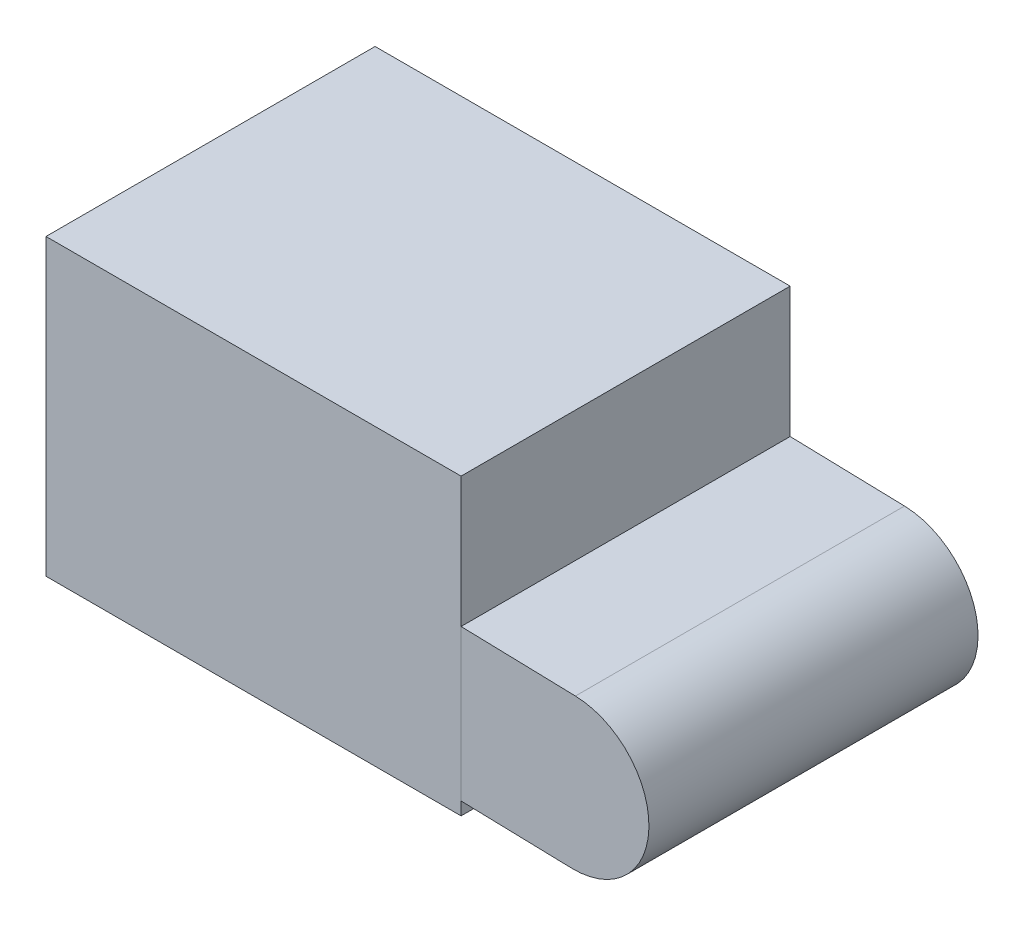
ISO-10303-21;
HEADER;
FILE_DESCRIPTION(('STEP AP214'),'2;1');
FILE_NAME('part.step','',(''),(''),'','','');
FILE_SCHEMA(('AUTOMOTIVE_DESIGN { 1 0 10303 214 1 1 1 1 }'));
ENDSEC;
DATA;
#1=APPLICATION_CONTEXT('core data for automotive mechanical design processes');
#2=APPLICATION_PROTOCOL_DEFINITION('international standard','automotive_design',2000,#1);
#3=PRODUCT_CONTEXT('',#1,'mechanical');
#4=PRODUCT('Part','Part','',(#3));
#5=PRODUCT_RELATED_PRODUCT_CATEGORY('part','',(#4));
#6=PRODUCT_DEFINITION_FORMATION('','',#4);
#7=PRODUCT_DEFINITION_CONTEXT('part definition',#1,'design');
#8=PRODUCT_DEFINITION('design','',#6,#7);
#9=PRODUCT_DEFINITION_SHAPE('','',#8);
#10=(LENGTH_UNIT() NAMED_UNIT(*) SI_UNIT(.MILLI.,.METRE.));
#11=(NAMED_UNIT(*) PLANE_ANGLE_UNIT() SI_UNIT($,.RADIAN.));
#12=(NAMED_UNIT(*) SI_UNIT($,.STERADIAN.) SOLID_ANGLE_UNIT());
#13=UNCERTAINTY_MEASURE_WITH_UNIT(LENGTH_MEASURE(1.E-05),#10,'distance_accuracy_value','');
#14=(GEOMETRIC_REPRESENTATION_CONTEXT(3) GLOBAL_UNCERTAINTY_ASSIGNED_CONTEXT((#13)) GLOBAL_UNIT_ASSIGNED_CONTEXT((#10,
#11,#12)) REPRESENTATION_CONTEXT('',''));
#15=CARTESIAN_POINT('',(0.,0.,0.));
#16=DIRECTION('',(0.,0.,1.));
#17=DIRECTION('',(1.,0.,0.));
#18=AXIS2_PLACEMENT_3D('',#15,#16,#17);
#19=CARTESIAN_POINT('',(35.1077098854944,-21.9746686635744,51.));
#20=DIRECTION('',(0.,0.,-1.));
#21=DIRECTION('',(-1.,0.,0.));
#22=AXIS2_PLACEMENT_3D('',#19,#20,#21);
#23=CYLINDRICAL_SURFACE('',#22,11.703993338653);
#24=CARTESIAN_POINT('',(35.1077098854944,-21.9746686635744,0.));
#25=DIRECTION('',(0.,0.,1.));
#26=DIRECTION('',(1.,0.,0.));
#27=AXIS2_PLACEMENT_3D('',#24,#25,#26);
#28=CIRCLE('',#27,11.703993338653);
#29=CARTESIAN_POINT('',(34.7969558700416,-33.6745358428682,0.));
#30=VERTEX_POINT('',#29);
#31=CARTESIAN_POINT('',(35.4184639009472,-10.2748014842807,0.));
#32=VERTEX_POINT('',#31);
#33=EDGE_CURVE('E108',#30,#32,#28,.T.);
#34=ORIENTED_EDGE('',*,*,#33,.T.);
#35=DIRECTION('',(0.,0.,-1.));
#36=VECTOR('',#35,1.);
#37=CARTESIAN_POINT('',(35.4184639009472,-10.2748014842807,51.));
#38=LINE('',#37,#36);
#39=CARTESIAN_POINT('',(35.4184639009472,-10.2748014842807,51.));
#40=VERTEX_POINT('',#39);
#41=EDGE_CURVE('E12',#40,#32,#38,.T.);
#42=ORIENTED_EDGE('',*,*,#41,.F.);
#43=CARTESIAN_POINT('',(35.1077098854944,-21.9746686635744,51.));
#44=DIRECTION('',(0.,0.,1.));
#45=DIRECTION('',(1.,0.,0.));
#46=AXIS2_PLACEMENT_3D('',#43,#44,#45);
#47=CIRCLE('',#46,11.703993338653);
#48=CARTESIAN_POINT('',(34.7969558700416,-33.6745358428682,51.));
#49=VERTEX_POINT('',#48);
#50=EDGE_CURVE('E96',#49,#40,#47,.T.);
#51=ORIENTED_EDGE('',*,*,#50,.F.);
#52=DIRECTION('',(0.,0.,-1.));
#53=VECTOR('',#52,1.);
#54=CARTESIAN_POINT('',(34.7969558700416,-33.6745358428682,51.));
#55=LINE('',#54,#53);
#56=EDGE_CURVE('E104',#49,#30,#55,.T.);
#57=ORIENTED_EDGE('',*,*,#56,.T.);
#58=EDGE_LOOP('',(#34,#42,#51,#57));
#59=FACE_BOUND('',#58,.T.);
#60=ADVANCED_FACE('F45',(#59),#23,.T.);
#61=CARTESIAN_POINT('',(35.4184639009472,-10.2748014842807,51.));
#62=DIRECTION('',(-0.0265511100750977,-0.999647457133654,0.));
#63=DIRECTION('',(0.999647457133654,-0.0265511100750977,0.));
#64=AXIS2_PLACEMENT_3D('',#61,#62,#63);
#65=PLANE('',#64);
#66=DIRECTION('',(-0.999647457133654,0.0265511100750977,0.));
#67=VECTOR('',#66,1.);
#68=CARTESIAN_POINT('',(35.4184639009472,-10.2748014842807,0.));
#69=LINE('',#68,#67);
#70=CARTESIAN_POINT('',(4.65808177789852,-9.45779116141854,0.));
#71=VERTEX_POINT('',#70);
#72=EDGE_CURVE('E100',#32,#71,#69,.T.);
#73=ORIENTED_EDGE('',*,*,#72,.T.);
#74=DIRECTION('',(0.,0.,-1.));
#75=VECTOR('',#74,1.);
#76=CARTESIAN_POINT('',(4.65808177789852,-9.45779116141854,51.));
#77=LINE('',#76,#75);
#78=CARTESIAN_POINT('',(4.65808177789852,-9.45779116141854,51.));
#79=VERTEX_POINT('',#78);
#80=EDGE_CURVE('E53',#79,#71,#77,.T.);
#81=ORIENTED_EDGE('',*,*,#80,.F.);
#82=DIRECTION('',(-0.999647457133654,0.0265511100750977,0.));
#83=VECTOR('',#82,1.);
#84=CARTESIAN_POINT('',(35.4184639009472,-10.2748014842807,51.));
#85=LINE('',#84,#83);
#86=EDGE_CURVE('E91',#40,#79,#85,.T.);
#87=ORIENTED_EDGE('',*,*,#86,.F.);
#88=ORIENTED_EDGE('',*,*,#41,.T.);
#89=EDGE_LOOP('',(#73,#81,#87,#88));
#90=FACE_BOUND('',#89,.T.);
#91=ADVANCED_FACE('F99',(#90),#65,.F.);
#92=CARTESIAN_POINT('',(4.34732776244573,-21.1576583407123,51.));
#93=DIRECTION('',(0.,0.,-1.));
#94=DIRECTION('',(-1.,0.,0.));
#95=AXIS2_PLACEMENT_3D('',#92,#93,#94);
#96=CYLINDRICAL_SURFACE('',#95,11.703993338653);
#97=CARTESIAN_POINT('',(4.34732776244573,-21.1576583407123,0.));
#98=DIRECTION('',(0.,0.,1.));
#99=DIRECTION('',(1.,0.,0.));
#100=AXIS2_PLACEMENT_3D('',#97,#98,#99);
#101=CIRCLE('',#100,11.703993338653);
#102=CARTESIAN_POINT('',(4.03657374699294,-32.857525520006,0.));
#103=VERTEX_POINT('',#102);
#104=EDGE_CURVE('E78',#71,#103,#101,.T.);
#105=ORIENTED_EDGE('',*,*,#104,.T.);
#106=DIRECTION('',(0.,0.,-1.));
#107=VECTOR('',#106,1.);
#108=CARTESIAN_POINT('',(4.03657374699294,-32.857525520006,51.));
#109=LINE('',#108,#107);
#110=CARTESIAN_POINT('',(4.03657374699294,-32.857525520006,51.));
#111=VERTEX_POINT('',#110);
#112=EDGE_CURVE('E101',#111,#103,#109,.T.);
#113=ORIENTED_EDGE('',*,*,#112,.F.);
#114=CARTESIAN_POINT('',(4.34732776244573,-21.1576583407123,51.));
#115=DIRECTION('',(0.,0.,1.));
#116=DIRECTION('',(1.,0.,0.));
#117=AXIS2_PLACEMENT_3D('',#114,#115,#116);
#118=CIRCLE('',#117,11.703993338653);
#119=EDGE_CURVE('E94',#79,#111,#118,.T.);
#120=ORIENTED_EDGE('',*,*,#119,.F.);
#121=ORIENTED_EDGE('',*,*,#80,.T.);
#122=EDGE_LOOP('',(#105,#113,#120,#121));
#123=FACE_BOUND('',#122,.T.);
#124=ADVANCED_FACE('F102',(#123),#96,.T.);
#125=CARTESIAN_POINT('',(34.7969558700416,-33.6745358428682,51.));
#126=DIRECTION('',(0.0265511100750977,0.999647457133654,0.));
#127=DIRECTION('',(-0.999647457133654,0.0265511100750977,0.));
#128=AXIS2_PLACEMENT_3D('',#125,#126,#127);
#129=PLANE('',#128);
#130=DIRECTION('',(0.999647457133654,-0.0265511100750977,0.));
#131=VECTOR('',#130,1.);
#132=CARTESIAN_POINT('',(34.7969558700416,-33.6745358428682,0.));
#133=LINE('',#132,#131);
#134=EDGE_CURVE('E84',#103,#30,#133,.T.);
#135=ORIENTED_EDGE('',*,*,#134,.T.);
#136=ORIENTED_EDGE('',*,*,#56,.F.);
#137=DIRECTION('',(0.999647457133654,-0.0265511100750977,0.));
#138=VECTOR('',#137,1.);
#139=CARTESIAN_POINT('',(34.7969558700416,-33.6745358428682,51.));
#140=LINE('',#139,#138);
#141=EDGE_CURVE('E61',#111,#49,#140,.T.);
#142=ORIENTED_EDGE('',*,*,#141,.F.);
#143=ORIENTED_EDGE('',*,*,#112,.T.);
#144=EDGE_LOOP('',(#135,#136,#142,#143));
#145=FACE_BOUND('',#144,.T.);
#146=ADVANCED_FACE('F115',(#145),#129,.F.);
#147=CARTESIAN_POINT('',(35.1077098854944,-21.9746686635744,51.));
#148=DIRECTION('',(0.,0.,1.));
#149=DIRECTION('',(1.,0.,0.));
#150=AXIS2_PLACEMENT_3D('',#147,#148,#149);
#151=PLANE('',#150);
#152=ORIENTED_EDGE('',*,*,#50,.T.);
#153=ORIENTED_EDGE('',*,*,#86,.T.);
#154=ORIENTED_EDGE('',*,*,#119,.T.);
#155=ORIENTED_EDGE('',*,*,#141,.T.);
#156=EDGE_LOOP('',(#152,#153,#154,#155));
#157=FACE_BOUND('',#156,.T.);
#158=ADVANCED_FACE('F92',(#157),#151,.T.);
#159=CARTESIAN_POINT('',(35.1077098854944,-21.9746686635744,0.));
#160=DIRECTION('',(0.,0.,1.));
#161=DIRECTION('',(1.,0.,0.));
#162=AXIS2_PLACEMENT_3D('',#159,#160,#161);
#163=PLANE('',#162);
#164=ORIENTED_EDGE('',*,*,#33,.F.);
#165=ORIENTED_EDGE('',*,*,#134,.F.);
#166=ORIENTED_EDGE('',*,*,#104,.F.);
#167=ORIENTED_EDGE('',*,*,#72,.F.);
#168=EDGE_LOOP('',(#164,#165,#166,#167));
#169=FACE_BOUND('',#168,.T.);
#170=ADVANCED_FACE('F118',(#169),#163,.F.);
#171=CLOSED_SHELL('',(#60,#91,#124,#146,#158,#170));
#172=MANIFOLD_SOLID_BREP('B2',#171);
#173=CARTESIAN_POINT('',(-46.6277300233939,10.3806260271059,51.));
#174=DIRECTION('',(1.,0.,0.));
#175=DIRECTION('',(0.,0.,-1.));
#176=AXIS2_PLACEMENT_3D('',#173,#174,#175);
#177=PLANE('',#176);
#178=DIRECTION('',(0.,-1.,0.));
#179=VECTOR('',#178,1.);
#180=CARTESIAN_POINT('',(-46.6277300233939,10.3806260271059,0.));
#181=LINE('',#180,#179);
#182=CARTESIAN_POINT('',(-46.6277300233939,10.3806260271059,0.));
#183=VERTEX_POINT('',#182);
#184=CARTESIAN_POINT('',(-46.6277300233939,-35.2260588132939,0.));
#185=VERTEX_POINT('',#184);
#186=EDGE_CURVE('E234',#183,#185,#181,.T.);
#187=ORIENTED_EDGE('',*,*,#186,.T.);
#188=DIRECTION('',(0.,0.,-1.));
#189=VECTOR('',#188,1.);
#190=CARTESIAN_POINT('',(-46.6277300233939,-35.2260588132939,51.));
#191=LINE('',#190,#189);
#192=CARTESIAN_POINT('',(-46.6277300233939,-35.2260588132939,51.));
#193=VERTEX_POINT('',#192);
#194=EDGE_CURVE('E43',#193,#185,#191,.T.);
#195=ORIENTED_EDGE('',*,*,#194,.F.);
#196=DIRECTION('',(0.,-1.,0.));
#197=VECTOR('',#196,1.);
#198=CARTESIAN_POINT('',(-46.6277300233939,10.3806260271059,51.));
#199=LINE('',#198,#197);
#200=CARTESIAN_POINT('',(-46.6277300233939,10.3806260271059,51.));
#201=VERTEX_POINT('',#200);
#202=EDGE_CURVE('E222',#201,#193,#199,.T.);
#203=ORIENTED_EDGE('',*,*,#202,.F.);
#204=DIRECTION('',(0.,0.,-1.));
#205=VECTOR('',#204,1.);
#206=CARTESIAN_POINT('',(-46.6277300233939,10.3806260271059,51.));
#207=LINE('',#206,#205);
#208=EDGE_CURVE('E230',#201,#183,#207,.T.);
#209=ORIENTED_EDGE('',*,*,#208,.T.);
#210=EDGE_LOOP('',(#187,#195,#203,#209));
#211=FACE_BOUND('',#210,.T.);
#212=ADVANCED_FACE('F171',(#211),#177,.F.);
#213=CARTESIAN_POINT('',(-46.6277300233939,-35.2260588132939,51.));
#214=DIRECTION('',(0.,1.,0.));
#215=DIRECTION('',(0.,0.,1.));
#216=AXIS2_PLACEMENT_3D('',#213,#214,#215);
#217=PLANE('',#216);
#218=DIRECTION('',(1.,0.,0.));
#219=VECTOR('',#218,1.);
#220=CARTESIAN_POINT('',(-46.6277300233939,-35.2260588132939,0.));
#221=LINE('',#220,#219);
#222=CARTESIAN_POINT('',(17.6981165052298,-35.2260588132939,0.));
#223=VERTEX_POINT('',#222);
#224=EDGE_CURVE('E226',#185,#223,#221,.T.);
#225=ORIENTED_EDGE('',*,*,#224,.T.);
#226=DIRECTION('',(0.,0.,-1.));
#227=VECTOR('',#226,1.);
#228=CARTESIAN_POINT('',(17.6981165052298,-35.2260588132939,51.));
#229=LINE('',#228,#227);
#230=CARTESIAN_POINT('',(17.6981165052298,-35.2260588132939,51.));
#231=VERTEX_POINT('',#230);
#232=EDGE_CURVE('E179',#231,#223,#229,.T.);
#233=ORIENTED_EDGE('',*,*,#232,.F.);
#234=DIRECTION('',(1.,0.,0.));
#235=VECTOR('',#234,1.);
#236=CARTESIAN_POINT('',(-46.6277300233939,-35.2260588132939,51.));
#237=LINE('',#236,#235);
#238=EDGE_CURVE('E217',#193,#231,#237,.T.);
#239=ORIENTED_EDGE('',*,*,#238,.F.);
#240=ORIENTED_EDGE('',*,*,#194,.T.);
#241=EDGE_LOOP('',(#225,#233,#239,#240));
#242=FACE_BOUND('',#241,.T.);
#243=ADVANCED_FACE('F225',(#242),#217,.F.);
#244=CARTESIAN_POINT('',(17.6981165052298,10.3806260271059,51.));
#245=DIRECTION('',(-1.,0.,0.));
#246=DIRECTION('',(0.,0.,1.));
#247=AXIS2_PLACEMENT_3D('',#244,#245,#246);
#248=PLANE('',#247);
#249=DIRECTION('',(0.,1.,0.));
#250=VECTOR('',#249,1.);
#251=CARTESIAN_POINT('',(17.6981165052298,10.3806260271059,0.));
#252=LINE('',#251,#250);
#253=CARTESIAN_POINT('',(17.6981165052298,10.3806260271059,0.));
#254=VERTEX_POINT('',#253);
#255=EDGE_CURVE('E204',#223,#254,#252,.T.);
#256=ORIENTED_EDGE('',*,*,#255,.T.);
#257=DIRECTION('',(0.,0.,-1.));
#258=VECTOR('',#257,1.);
#259=CARTESIAN_POINT('',(17.6981165052298,10.3806260271059,51.));
#260=LINE('',#259,#258);
#261=CARTESIAN_POINT('',(17.6981165052298,10.3806260271059,51.));
#262=VERTEX_POINT('',#261);
#263=EDGE_CURVE('E227',#262,#254,#260,.T.);
#264=ORIENTED_EDGE('',*,*,#263,.F.);
#265=DIRECTION('',(0.,1.,0.));
#266=VECTOR('',#265,1.);
#267=CARTESIAN_POINT('',(17.6981165052298,10.3806260271059,51.));
#268=LINE('',#267,#266);
#269=EDGE_CURVE('E220',#231,#262,#268,.T.);
#270=ORIENTED_EDGE('',*,*,#269,.F.);
#271=ORIENTED_EDGE('',*,*,#232,.T.);
#272=EDGE_LOOP('',(#256,#264,#270,#271));
#273=FACE_BOUND('',#272,.T.);
#274=ADVANCED_FACE('F228',(#273),#248,.F.);
#275=CARTESIAN_POINT('',(-46.6277300233939,10.3806260271059,51.));
#276=DIRECTION('',(0.,-1.,0.));
#277=DIRECTION('',(0.,0.,-1.));
#278=AXIS2_PLACEMENT_3D('',#275,#276,#277);
#279=PLANE('',#278);
#280=DIRECTION('',(-1.,0.,0.));
#281=VECTOR('',#280,1.);
#282=CARTESIAN_POINT('',(-46.6277300233939,10.3806260271059,0.));
#283=LINE('',#282,#281);
#284=EDGE_CURVE('E210',#254,#183,#283,.T.);
#285=ORIENTED_EDGE('',*,*,#284,.T.);
#286=ORIENTED_EDGE('',*,*,#208,.F.);
#287=DIRECTION('',(-1.,0.,0.));
#288=VECTOR('',#287,1.);
#289=CARTESIAN_POINT('',(-46.6277300233939,10.3806260271059,51.));
#290=LINE('',#289,#288);
#291=EDGE_CURVE('E187',#262,#201,#290,.T.);
#292=ORIENTED_EDGE('',*,*,#291,.F.);
#293=ORIENTED_EDGE('',*,*,#263,.T.);
#294=EDGE_LOOP('',(#285,#286,#292,#293));
#295=FACE_BOUND('',#294,.T.);
#296=ADVANCED_FACE('F241',(#295),#279,.F.);
#297=CARTESIAN_POINT('',(0.,0.,51.));
#298=DIRECTION('',(0.,0.,1.));
#299=DIRECTION('',(1.,0.,0.));
#300=AXIS2_PLACEMENT_3D('',#297,#298,#299);
#301=PLANE('',#300);
#302=ORIENTED_EDGE('',*,*,#202,.T.);
#303=ORIENTED_EDGE('',*,*,#238,.T.);
#304=ORIENTED_EDGE('',*,*,#269,.T.);
#305=ORIENTED_EDGE('',*,*,#291,.T.);
#306=EDGE_LOOP('',(#302,#303,#304,#305));
#307=FACE_BOUND('',#306,.T.);
#308=ADVANCED_FACE('F218',(#307),#301,.T.);
#309=CARTESIAN_POINT('',(0.,0.,0.));
#310=DIRECTION('',(0.,0.,1.));
#311=DIRECTION('',(1.,0.,0.));
#312=AXIS2_PLACEMENT_3D('',#309,#310,#311);
#313=PLANE('',#312);
#314=ORIENTED_EDGE('',*,*,#186,.F.);
#315=ORIENTED_EDGE('',*,*,#284,.F.);
#316=ORIENTED_EDGE('',*,*,#255,.F.);
#317=ORIENTED_EDGE('',*,*,#224,.F.);
#318=EDGE_LOOP('',(#314,#315,#316,#317));
#319=FACE_BOUND('',#318,.T.);
#320=ADVANCED_FACE('F244',(#319),#313,.F.);
#321=CLOSED_SHELL('',(#212,#243,#274,#296,#308,#320));
#322=MANIFOLD_SOLID_BREP('B6',#321);
#323=ADVANCED_BREP_SHAPE_REPRESENTATION('',(#18,#172,#322),#14);
#324=SHAPE_DEFINITION_REPRESENTATION(#9,#323);
ENDSEC;
END-ISO-10303-21;
